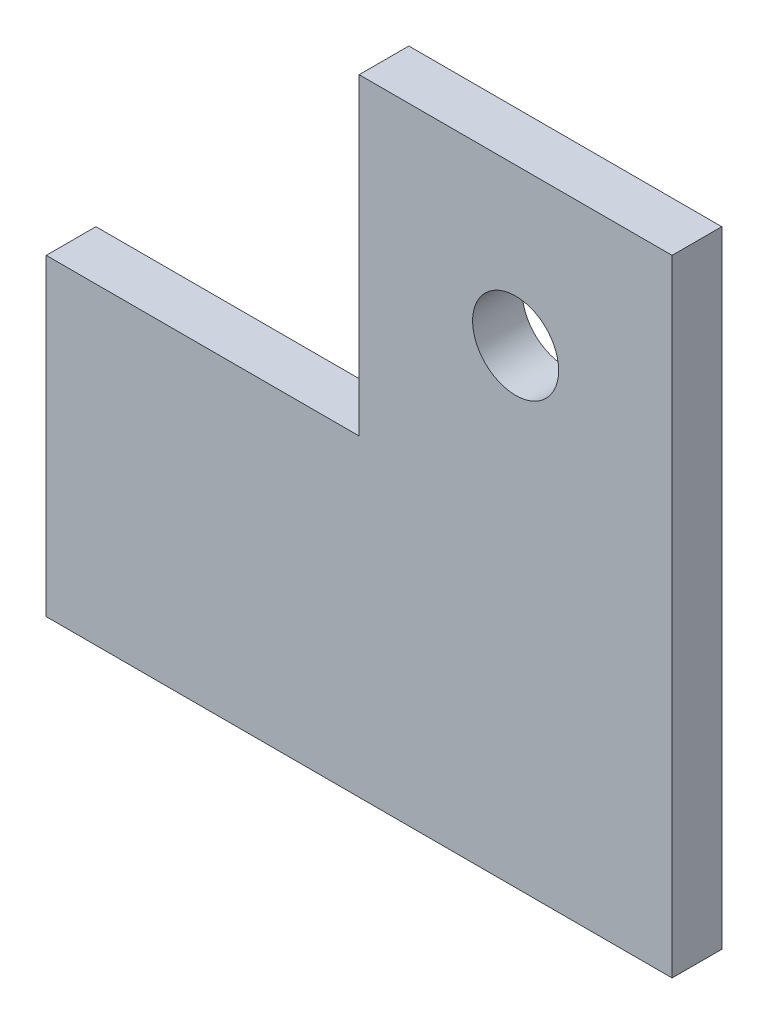
ISO-10303-21;
HEADER;
FILE_DESCRIPTION(('STEP AP214'),'2;1');
FILE_NAME('part.step','',(''),(''),'','','');
FILE_SCHEMA(('AUTOMOTIVE_DESIGN { 1 0 10303 214 1 1 1 1 }'));
ENDSEC;
DATA;
#1=APPLICATION_CONTEXT('core data for automotive mechanical design processes');
#2=APPLICATION_PROTOCOL_DEFINITION('international standard','automotive_design',2000,#1);
#3=PRODUCT_CONTEXT('',#1,'mechanical');
#4=PRODUCT('Part','Part','',(#3));
#5=PRODUCT_RELATED_PRODUCT_CATEGORY('part','',(#4));
#6=PRODUCT_DEFINITION_FORMATION('','',#4);
#7=PRODUCT_DEFINITION_CONTEXT('part definition',#1,'design');
#8=PRODUCT_DEFINITION('design','',#6,#7);
#9=PRODUCT_DEFINITION_SHAPE('','',#8);
#10=(LENGTH_UNIT() NAMED_UNIT(*) SI_UNIT(.MILLI.,.METRE.));
#11=(NAMED_UNIT(*) PLANE_ANGLE_UNIT() SI_UNIT($,.RADIAN.));
#12=(NAMED_UNIT(*) SI_UNIT($,.STERADIAN.) SOLID_ANGLE_UNIT());
#13=UNCERTAINTY_MEASURE_WITH_UNIT(LENGTH_MEASURE(1.E-05),#10,'distance_accuracy_value','');
#14=(GEOMETRIC_REPRESENTATION_CONTEXT(3) GLOBAL_UNCERTAINTY_ASSIGNED_CONTEXT((#13)) GLOBAL_UNIT_ASSIGNED_CONTEXT((#10,
#11,#12)) REPRESENTATION_CONTEXT('',''));
#15=CARTESIAN_POINT('',(0.,0.,0.));
#16=DIRECTION('',(0.,0.,1.));
#17=DIRECTION('',(1.,0.,0.));
#18=AXIS2_PLACEMENT_3D('',#15,#16,#17);
#19=CARTESIAN_POINT('',(0.,-20.,3.175));
#20=DIRECTION('',(1.,0.,0.));
#21=DIRECTION('',(0.,0.,-1.));
#22=AXIS2_PLACEMENT_3D('',#19,#20,#21);
#23=PLANE('',#22);
#24=DIRECTION('',(0.,-1.,0.));
#25=VECTOR('',#24,1.);
#26=CARTESIAN_POINT('',(0.,-20.,0.));
#27=LINE('',#26,#25);
#28=CARTESIAN_POINT('',(0.,0.,0.));
#29=VERTEX_POINT('',#28);
#30=CARTESIAN_POINT('',(0.,-20.,0.));
#31=VERTEX_POINT('',#30);
#32=EDGE_CURVE('E123',#29,#31,#27,.T.);
#33=ORIENTED_EDGE('',*,*,#32,.T.);
#34=DIRECTION('',(0.,0.,-1.));
#35=VECTOR('',#34,1.);
#36=CARTESIAN_POINT('',(0.,-20.,3.175));
#37=LINE('',#36,#35);
#38=CARTESIAN_POINT('',(0.,-20.,3.175));
#39=VERTEX_POINT('',#38);
#40=EDGE_CURVE('E11',#39,#31,#37,.T.);
#41=ORIENTED_EDGE('',*,*,#40,.F.);
#42=DIRECTION('',(0.,-1.,0.));
#43=VECTOR('',#42,1.);
#44=CARTESIAN_POINT('',(0.,-20.,3.175));
#45=LINE('',#44,#43);
#46=CARTESIAN_POINT('',(0.,0.,3.175));
#47=VERTEX_POINT('',#46);
#48=EDGE_CURVE('E134',#47,#39,#45,.T.);
#49=ORIENTED_EDGE('',*,*,#48,.F.);
#50=DIRECTION('',(0.,0.,-1.));
#51=VECTOR('',#50,1.);
#52=CARTESIAN_POINT('',(0.,0.,3.175));
#53=LINE('',#52,#51);
#54=EDGE_CURVE('E119',#47,#29,#53,.T.);
#55=ORIENTED_EDGE('',*,*,#54,.T.);
#56=EDGE_LOOP('',(#33,#41,#49,#55));
#57=FACE_BOUND('',#56,.T.);
#58=ADVANCED_FACE('F39',(#57),#23,.F.);
#59=CARTESIAN_POINT('',(40.,-20.,3.175));
#60=DIRECTION('',(0.,1.,0.));
#61=DIRECTION('',(-1.,0.,0.));
#62=AXIS2_PLACEMENT_3D('',#59,#60,#61);
#63=PLANE('',#62);
#64=DIRECTION('',(1.,0.,0.));
#65=VECTOR('',#64,1.);
#66=CARTESIAN_POINT('',(40.,-20.,0.));
#67=LINE('',#66,#65);
#68=CARTESIAN_POINT('',(40.,-20.,0.));
#69=VERTEX_POINT('',#68);
#70=EDGE_CURVE('E126',#31,#69,#67,.T.);
#71=ORIENTED_EDGE('',*,*,#70,.T.);
#72=DIRECTION('',(0.,0.,-1.));
#73=VECTOR('',#72,1.);
#74=CARTESIAN_POINT('',(40.,-20.,3.175));
#75=LINE('',#74,#73);
#76=CARTESIAN_POINT('',(40.,-20.,3.175));
#77=VERTEX_POINT('',#76);
#78=EDGE_CURVE('E47',#77,#69,#75,.T.);
#79=ORIENTED_EDGE('',*,*,#78,.F.);
#80=DIRECTION('',(1.,0.,0.));
#81=VECTOR('',#80,1.);
#82=CARTESIAN_POINT('',(40.,-20.,3.175));
#83=LINE('',#82,#81);
#84=EDGE_CURVE('E92',#39,#77,#83,.T.);
#85=ORIENTED_EDGE('',*,*,#84,.F.);
#86=ORIENTED_EDGE('',*,*,#40,.T.);
#87=EDGE_LOOP('',(#71,#79,#85,#86));
#88=FACE_BOUND('',#87,.T.);
#89=ADVANCED_FACE('F159',(#88),#63,.F.);
#90=CARTESIAN_POINT('',(40.,20.,3.175));
#91=DIRECTION('',(-1.,0.,0.));
#92=DIRECTION('',(0.,0.,1.));
#93=AXIS2_PLACEMENT_3D('',#90,#91,#92);
#94=PLANE('',#93);
#95=DIRECTION('',(0.,1.,0.));
#96=VECTOR('',#95,1.);
#97=CARTESIAN_POINT('',(40.,20.,0.));
#98=LINE('',#97,#96);
#99=CARTESIAN_POINT('',(40.,20.,0.));
#100=VERTEX_POINT('',#99);
#101=EDGE_CURVE('E129',#69,#100,#98,.T.);
#102=ORIENTED_EDGE('',*,*,#101,.T.);
#103=DIRECTION('',(0.,0.,-1.));
#104=VECTOR('',#103,1.);
#105=CARTESIAN_POINT('',(40.,20.,3.175));
#106=LINE('',#105,#104);
#107=CARTESIAN_POINT('',(40.,20.,3.175));
#108=VERTEX_POINT('',#107);
#109=EDGE_CURVE('E114',#108,#100,#106,.T.);
#110=ORIENTED_EDGE('',*,*,#109,.F.);
#111=DIRECTION('',(0.,1.,0.));
#112=VECTOR('',#111,1.);
#113=CARTESIAN_POINT('',(40.,20.,3.175));
#114=LINE('',#113,#112);
#115=EDGE_CURVE('E105',#77,#108,#114,.T.);
#116=ORIENTED_EDGE('',*,*,#115,.F.);
#117=ORIENTED_EDGE('',*,*,#78,.T.);
#118=EDGE_LOOP('',(#102,#110,#116,#117));
#119=FACE_BOUND('',#118,.T.);
#120=ADVANCED_FACE('F140',(#119),#94,.F.);
#121=CARTESIAN_POINT('',(40.,20.,3.175));
#122=DIRECTION('',(0.,-1.,0.));
#123=DIRECTION('',(1.,0.,0.));
#124=AXIS2_PLACEMENT_3D('',#121,#122,#123);
#125=PLANE('',#124);
#126=DIRECTION('',(-1.,0.,0.));
#127=VECTOR('',#126,1.);
#128=CARTESIAN_POINT('',(40.,20.,0.));
#129=LINE('',#128,#127);
#130=CARTESIAN_POINT('',(20.,20.,0.));
#131=VERTEX_POINT('',#130);
#132=EDGE_CURVE('E113',#100,#131,#129,.T.);
#133=ORIENTED_EDGE('',*,*,#132,.T.);
#134=DIRECTION('',(0.,0.,-1.));
#135=VECTOR('',#134,1.);
#136=CARTESIAN_POINT('',(20.,20.,3.175));
#137=LINE('',#136,#135);
#138=CARTESIAN_POINT('',(20.,20.,3.175));
#139=VERTEX_POINT('',#138);
#140=EDGE_CURVE('E110',#139,#131,#137,.T.);
#141=ORIENTED_EDGE('',*,*,#140,.F.);
#142=DIRECTION('',(-1.,0.,0.));
#143=VECTOR('',#142,1.);
#144=CARTESIAN_POINT('',(40.,20.,3.175));
#145=LINE('',#144,#143);
#146=EDGE_CURVE('E99',#108,#139,#145,.T.);
#147=ORIENTED_EDGE('',*,*,#146,.F.);
#148=ORIENTED_EDGE('',*,*,#109,.T.);
#149=EDGE_LOOP('',(#133,#141,#147,#148));
#150=FACE_BOUND('',#149,.T.);
#151=ADVANCED_FACE('F111',(#150),#125,.F.);
#152=CARTESIAN_POINT('',(20.,0.,3.175));
#153=DIRECTION('',(1.,0.,0.));
#154=DIRECTION('',(0.,0.,-1.));
#155=AXIS2_PLACEMENT_3D('',#152,#153,#154);
#156=PLANE('',#155);
#157=DIRECTION('',(0.,-1.,0.));
#158=VECTOR('',#157,1.);
#159=CARTESIAN_POINT('',(20.,0.,0.));
#160=LINE('',#159,#158);
#161=CARTESIAN_POINT('',(20.,0.,0.));
#162=VERTEX_POINT('',#161);
#163=EDGE_CURVE('E78',#131,#162,#160,.T.);
#164=ORIENTED_EDGE('',*,*,#163,.T.);
#165=DIRECTION('',(0.,0.,-1.));
#166=VECTOR('',#165,1.);
#167=CARTESIAN_POINT('',(20.,0.,3.175));
#168=LINE('',#167,#166);
#169=CARTESIAN_POINT('',(20.,0.,3.175));
#170=VERTEX_POINT('',#169);
#171=EDGE_CURVE('E115',#170,#162,#168,.T.);
#172=ORIENTED_EDGE('',*,*,#171,.F.);
#173=DIRECTION('',(0.,-1.,0.));
#174=VECTOR('',#173,1.);
#175=CARTESIAN_POINT('',(20.,0.,3.175));
#176=LINE('',#175,#174);
#177=EDGE_CURVE('E103',#139,#170,#176,.T.);
#178=ORIENTED_EDGE('',*,*,#177,.F.);
#179=ORIENTED_EDGE('',*,*,#140,.T.);
#180=EDGE_LOOP('',(#164,#172,#178,#179));
#181=FACE_BOUND('',#180,.T.);
#182=ADVANCED_FACE('F117',(#181),#156,.F.);
#183=CARTESIAN_POINT('',(0.,0.,3.175));
#184=DIRECTION('',(0.,-1.,0.));
#185=DIRECTION('',(0.,0.,-1.));
#186=AXIS2_PLACEMENT_3D('',#183,#184,#185);
#187=PLANE('',#186);
#188=DIRECTION('',(-1.,0.,0.));
#189=VECTOR('',#188,1.);
#190=CARTESIAN_POINT('',(0.,0.,0.));
#191=LINE('',#190,#189);
#192=EDGE_CURVE('E84',#162,#29,#191,.T.);
#193=ORIENTED_EDGE('',*,*,#192,.T.);
#194=ORIENTED_EDGE('',*,*,#54,.F.);
#195=DIRECTION('',(-1.,0.,0.));
#196=VECTOR('',#195,1.);
#197=CARTESIAN_POINT('',(0.,0.,3.175));
#198=LINE('',#197,#196);
#199=EDGE_CURVE('E55',#170,#47,#198,.T.);
#200=ORIENTED_EDGE('',*,*,#199,.F.);
#201=ORIENTED_EDGE('',*,*,#171,.T.);
#202=EDGE_LOOP('',(#193,#194,#200,#201));
#203=FACE_BOUND('',#202,.T.);
#204=ADVANCED_FACE('F147',(#203),#187,.F.);
#205=CARTESIAN_POINT('',(0.,0.,3.175));
#206=DIRECTION('',(0.,0.,-1.));
#207=DIRECTION('',(-1.,0.,0.));
#208=AXIS2_PLACEMENT_3D('',#205,#206,#207);
#209=PLANE('',#208);
#210=CARTESIAN_POINT('',(30.,10.,3.175));
#211=DIRECTION('',(0.,0.,1.));
#212=DIRECTION('',(1.,0.,0.));
#213=AXIS2_PLACEMENT_3D('',#210,#211,#212);
#214=CIRCLE('',#213,2.75);
#215=CARTESIAN_POINT('',(32.75,10.,3.175));
#216=VERTEX_POINT('',#215);
#217=EDGE_CURVE('E127',#216,#216,#214,.T.);
#218=ORIENTED_EDGE('',*,*,#217,.F.);
#219=EDGE_LOOP('',(#218));
#220=FACE_BOUND('',#219,.T.);
#221=ORIENTED_EDGE('',*,*,#48,.T.);
#222=ORIENTED_EDGE('',*,*,#84,.T.);
#223=ORIENTED_EDGE('',*,*,#115,.T.);
#224=ORIENTED_EDGE('',*,*,#146,.T.);
#225=ORIENTED_EDGE('',*,*,#177,.T.);
#226=ORIENTED_EDGE('',*,*,#199,.T.);
#227=EDGE_LOOP('',(#221,#222,#223,#224,#225,#226));
#228=FACE_BOUND('',#227,.T.);
#229=ADVANCED_FACE('F101',(#220,#228),#209,.F.);
#230=CARTESIAN_POINT('',(0.,0.,0.));
#231=DIRECTION('',(0.,0.,-1.));
#232=DIRECTION('',(-1.,0.,0.));
#233=AXIS2_PLACEMENT_3D('',#230,#231,#232);
#234=PLANE('',#233);
#235=CARTESIAN_POINT('',(30.,10.,0.));
#236=DIRECTION('',(0.,0.,-1.));
#237=DIRECTION('',(-1.,0.,0.));
#238=AXIS2_PLACEMENT_3D('',#235,#236,#237);
#239=CIRCLE('',#238,2.75);
#240=CARTESIAN_POINT('',(27.25,10.,0.));
#241=VERTEX_POINT('',#240);
#242=EDGE_CURVE('E213',#241,#241,#239,.F.);
#243=ORIENTED_EDGE('',*,*,#242,.T.);
#244=EDGE_LOOP('',(#243));
#245=FACE_BOUND('',#244,.T.);
#246=ORIENTED_EDGE('',*,*,#32,.F.);
#247=ORIENTED_EDGE('',*,*,#192,.F.);
#248=ORIENTED_EDGE('',*,*,#163,.F.);
#249=ORIENTED_EDGE('',*,*,#132,.F.);
#250=ORIENTED_EDGE('',*,*,#101,.F.);
#251=ORIENTED_EDGE('',*,*,#70,.F.);
#252=EDGE_LOOP('',(#246,#247,#248,#249,#250,#251));
#253=FACE_BOUND('',#252,.T.);
#254=ADVANCED_FACE('F143',(#245,#253),#234,.T.);
#255=CARTESIAN_POINT('',(30.,10.,-0.00100000000000013));
#256=DIRECTION('',(0.,0.,1.));
#257=DIRECTION('',(1.,0.,0.));
#258=AXIS2_PLACEMENT_3D('',#255,#256,#257);
#259=CYLINDRICAL_SURFACE('',#258,2.75);
#260=ORIENTED_EDGE('',*,*,#242,.F.);
#261=EDGE_LOOP('',(#260));
#262=FACE_BOUND('',#261,.T.);
#263=ORIENTED_EDGE('',*,*,#217,.T.);
#264=EDGE_LOOP('',(#263));
#265=FACE_BOUND('',#264,.T.);
#266=ADVANCED_FACE('F198',(#262,#265),#259,.F.);
#267=CLOSED_SHELL('',(#58,#89,#120,#151,#182,#204,#229,#254,#266));
#268=MANIFOLD_SOLID_BREP('B2',#267);
#269=ADVANCED_BREP_SHAPE_REPRESENTATION('',(#18,#268),#14);
#270=SHAPE_DEFINITION_REPRESENTATION(#9,#269);
ENDSEC;
END-ISO-10303-21;
